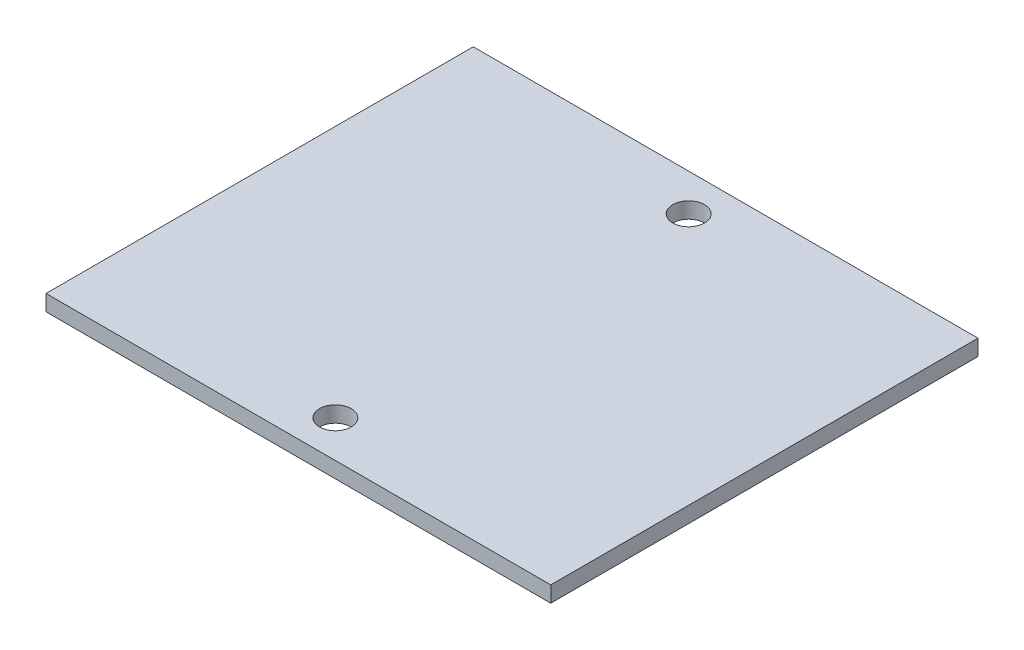
ISO-10303-21;
HEADER;
FILE_DESCRIPTION(('STEP AP214'),'2;1');
FILE_NAME('part.step','',(''),(''),'','','');
FILE_SCHEMA(('AUTOMOTIVE_DESIGN { 1 0 10303 214 1 1 1 1 }'));
ENDSEC;
DATA;
#1=APPLICATION_CONTEXT('core data for automotive mechanical design processes');
#2=APPLICATION_PROTOCOL_DEFINITION('international standard','automotive_design',2000,#1);
#3=PRODUCT_CONTEXT('',#1,'mechanical');
#4=PRODUCT('Part','Part','',(#3));
#5=PRODUCT_RELATED_PRODUCT_CATEGORY('part','',(#4));
#6=PRODUCT_DEFINITION_FORMATION('','',#4);
#7=PRODUCT_DEFINITION_CONTEXT('part definition',#1,'design');
#8=PRODUCT_DEFINITION('design','',#6,#7);
#9=PRODUCT_DEFINITION_SHAPE('','',#8);
#10=(LENGTH_UNIT() NAMED_UNIT(*) SI_UNIT(.MILLI.,.METRE.));
#11=(NAMED_UNIT(*) PLANE_ANGLE_UNIT() SI_UNIT($,.RADIAN.));
#12=(NAMED_UNIT(*) SI_UNIT($,.STERADIAN.) SOLID_ANGLE_UNIT());
#13=UNCERTAINTY_MEASURE_WITH_UNIT(LENGTH_MEASURE(1.E-05),#10,'distance_accuracy_value','');
#14=(GEOMETRIC_REPRESENTATION_CONTEXT(3) GLOBAL_UNCERTAINTY_ASSIGNED_CONTEXT((#13)) GLOBAL_UNIT_ASSIGNED_CONTEXT((#10,
#11,#12)) REPRESENTATION_CONTEXT('',''));
#15=CARTESIAN_POINT('',(0.,0.,0.));
#16=DIRECTION('',(0.,0.,1.));
#17=DIRECTION('',(1.,0.,0.));
#18=AXIS2_PLACEMENT_3D('',#15,#16,#17);
#19=CARTESIAN_POINT('',(0.,1.6002,0.));
#20=DIRECTION('',(0.,-1.,0.));
#21=DIRECTION('',(0.,0.,-1.));
#22=AXIS2_PLACEMENT_3D('',#19,#20,#21);
#23=PLANE('',#22);
#24=DIRECTION('',(0.,0.,1.));
#25=VECTOR('',#24,1.);
#26=CARTESIAN_POINT('',(0.,1.6002,0.));
#27=LINE('',#26,#25);
#28=CARTESIAN_POINT('',(0.,1.6002,-43.));
#29=VERTEX_POINT('',#28);
#30=CARTESIAN_POINT('',(0.,1.6002,0.));
#31=VERTEX_POINT('',#30);
#32=EDGE_CURVE('E89',#29,#31,#27,.T.);
#33=ORIENTED_EDGE('',*,*,#32,.T.);
#34=DIRECTION('',(1.,0.,0.));
#35=VECTOR('',#34,1.);
#36=CARTESIAN_POINT('',(0.,1.6002,0.));
#37=LINE('',#36,#35);
#38=CARTESIAN_POINT('',(50.8,1.6002,0.));
#39=VERTEX_POINT('',#38);
#40=EDGE_CURVE('E84',#31,#39,#37,.T.);
#41=ORIENTED_EDGE('',*,*,#40,.T.);
#42=DIRECTION('',(0.,0.,-1.));
#43=VECTOR('',#42,1.);
#44=CARTESIAN_POINT('',(50.8,1.6002,0.));
#45=LINE('',#44,#43);
#46=CARTESIAN_POINT('',(50.8,1.6002,-43.));
#47=VERTEX_POINT('',#46);
#48=EDGE_CURVE('E87',#39,#47,#45,.T.);
#49=ORIENTED_EDGE('',*,*,#48,.T.);
#50=DIRECTION('',(-1.,0.,0.));
#51=VECTOR('',#50,1.);
#52=CARTESIAN_POINT('',(0.,1.6002,-43.));
#53=LINE('',#52,#51);
#54=EDGE_CURVE('E54',#47,#29,#53,.T.);
#55=ORIENTED_EDGE('',*,*,#54,.T.);
#56=EDGE_LOOP('',(#33,#41,#49,#55));
#57=FACE_BOUND('',#56,.T.);
#58=CARTESIAN_POINT('',(25.4,1.6002,-3.72));
#59=DIRECTION('',(0.,1.,0.));
#60=DIRECTION('',(0.,0.,1.));
#61=AXIS2_PLACEMENT_3D('',#58,#59,#60);
#62=CIRCLE('',#61,1.599999975);
#63=CARTESIAN_POINT('',(25.4,1.6002,-2.120000025));
#64=VERTEX_POINT('',#63);
#65=EDGE_CURVE('E104',#64,#64,#62,.T.);
#66=ORIENTED_EDGE('',*,*,#65,.F.);
#67=EDGE_LOOP('',(#66));
#68=FACE_BOUND('',#67,.T.);
#69=CARTESIAN_POINT('',(25.4,1.6002,-39.28));
#70=DIRECTION('',(0.,1.,0.));
#71=DIRECTION('',(0.,0.,1.));
#72=AXIS2_PLACEMENT_3D('',#69,#70,#71);
#73=CIRCLE('',#72,1.599999975);
#74=CARTESIAN_POINT('',(25.4,1.6002,-37.680000025));
#75=VERTEX_POINT('',#74);
#76=EDGE_CURVE('E119',#75,#75,#73,.T.);
#77=ORIENTED_EDGE('',*,*,#76,.F.);
#78=EDGE_LOOP('',(#77));
#79=FACE_BOUND('',#78,.T.);
#80=ADVANCED_FACE('F37',(#57,#68,#79),#23,.F.);
#81=CARTESIAN_POINT('',(0.,0.,0.));
#82=DIRECTION('',(0.,-1.,0.));
#83=DIRECTION('',(0.,0.,-1.));
#84=AXIS2_PLACEMENT_3D('',#81,#82,#83);
#85=PLANE('',#84);
#86=CARTESIAN_POINT('',(25.4,0.,-3.72));
#87=DIRECTION('',(0.,1.,0.));
#88=DIRECTION('',(0.,0.,1.));
#89=AXIS2_PLACEMENT_3D('',#86,#87,#88);
#90=CIRCLE('',#89,1.599999975);
#91=CARTESIAN_POINT('',(25.4,0.,-2.120000025));
#92=VERTEX_POINT('',#91);
#93=EDGE_CURVE('E116',#92,#92,#90,.T.);
#94=ORIENTED_EDGE('',*,*,#93,.T.);
#95=EDGE_LOOP('',(#94));
#96=FACE_BOUND('',#95,.T.);
#97=DIRECTION('',(0.,0.,1.));
#98=VECTOR('',#97,1.);
#99=CARTESIAN_POINT('',(0.,0.,0.));
#100=LINE('',#99,#98);
#101=CARTESIAN_POINT('',(0.,0.,-43.));
#102=VERTEX_POINT('',#101);
#103=CARTESIAN_POINT('',(0.,0.,0.));
#104=VERTEX_POINT('',#103);
#105=EDGE_CURVE('E101',#102,#104,#100,.T.);
#106=ORIENTED_EDGE('',*,*,#105,.F.);
#107=DIRECTION('',(-1.,0.,0.));
#108=VECTOR('',#107,1.);
#109=CARTESIAN_POINT('',(0.,0.,-43.));
#110=LINE('',#109,#108);
#111=CARTESIAN_POINT('',(50.8,0.,-43.));
#112=VERTEX_POINT('',#111);
#113=EDGE_CURVE('E77',#112,#102,#110,.T.);
#114=ORIENTED_EDGE('',*,*,#113,.F.);
#115=DIRECTION('',(0.,0.,-1.));
#116=VECTOR('',#115,1.);
#117=CARTESIAN_POINT('',(50.8,0.,0.));
#118=LINE('',#117,#116);
#119=CARTESIAN_POINT('',(50.8,0.,0.));
#120=VERTEX_POINT('',#119);
#121=EDGE_CURVE('E71',#120,#112,#118,.T.);
#122=ORIENTED_EDGE('',*,*,#121,.F.);
#123=DIRECTION('',(1.,0.,0.));
#124=VECTOR('',#123,1.);
#125=CARTESIAN_POINT('',(0.,0.,0.));
#126=LINE('',#125,#124);
#127=EDGE_CURVE('E93',#104,#120,#126,.T.);
#128=ORIENTED_EDGE('',*,*,#127,.F.);
#129=EDGE_LOOP('',(#106,#114,#122,#128));
#130=FACE_BOUND('',#129,.T.);
#131=CARTESIAN_POINT('',(25.4,0.,-39.28));
#132=DIRECTION('',(0.,1.,0.));
#133=DIRECTION('',(0.,0.,1.));
#134=AXIS2_PLACEMENT_3D('',#131,#132,#133);
#135=CIRCLE('',#134,1.599999975);
#136=CARTESIAN_POINT('',(25.4,0.,-37.680000025));
#137=VERTEX_POINT('',#136);
#138=EDGE_CURVE('E122',#137,#137,#135,.T.);
#139=ORIENTED_EDGE('',*,*,#138,.T.);
#140=EDGE_LOOP('',(#139));
#141=FACE_BOUND('',#140,.T.);
#142=ADVANCED_FACE('F112',(#96,#130,#141),#85,.T.);
#143=CARTESIAN_POINT('',(0.,1.6002,0.));
#144=DIRECTION('',(1.,0.,0.));
#145=DIRECTION('',(0.,0.,-1.));
#146=AXIS2_PLACEMENT_3D('',#143,#144,#145);
#147=PLANE('',#146);
#148=ORIENTED_EDGE('',*,*,#105,.T.);
#149=DIRECTION('',(0.,-1.,0.));
#150=VECTOR('',#149,1.);
#151=CARTESIAN_POINT('',(0.,1.6002,0.));
#152=LINE('',#151,#150);
#153=EDGE_CURVE('E11',#31,#104,#152,.T.);
#154=ORIENTED_EDGE('',*,*,#153,.F.);
#155=ORIENTED_EDGE('',*,*,#32,.F.);
#156=DIRECTION('',(0.,-1.,0.));
#157=VECTOR('',#156,1.);
#158=CARTESIAN_POINT('',(0.,1.6002,-43.));
#159=LINE('',#158,#157);
#160=EDGE_CURVE('E97',#29,#102,#159,.T.);
#161=ORIENTED_EDGE('',*,*,#160,.T.);
#162=EDGE_LOOP('',(#148,#154,#155,#161));
#163=FACE_BOUND('',#162,.T.);
#164=ADVANCED_FACE('F39',(#163),#147,.F.);
#165=CARTESIAN_POINT('',(0.,1.6002,0.));
#166=DIRECTION('',(0.,0.,-1.));
#167=DIRECTION('',(-1.,0.,0.));
#168=AXIS2_PLACEMENT_3D('',#165,#166,#167);
#169=PLANE('',#168);
#170=ORIENTED_EDGE('',*,*,#127,.T.);
#171=DIRECTION('',(0.,-1.,0.));
#172=VECTOR('',#171,1.);
#173=CARTESIAN_POINT('',(50.8,1.6002,0.));
#174=LINE('',#173,#172);
#175=EDGE_CURVE('E46',#39,#120,#174,.T.);
#176=ORIENTED_EDGE('',*,*,#175,.F.);
#177=ORIENTED_EDGE('',*,*,#40,.F.);
#178=ORIENTED_EDGE('',*,*,#153,.T.);
#179=EDGE_LOOP('',(#170,#176,#177,#178));
#180=FACE_BOUND('',#179,.T.);
#181=ADVANCED_FACE('F92',(#180),#169,.F.);
#182=CARTESIAN_POINT('',(50.8,1.6002,0.));
#183=DIRECTION('',(-1.,0.,0.));
#184=DIRECTION('',(0.,0.,1.));
#185=AXIS2_PLACEMENT_3D('',#182,#183,#184);
#186=PLANE('',#185);
#187=ORIENTED_EDGE('',*,*,#121,.T.);
#188=DIRECTION('',(0.,-1.,0.));
#189=VECTOR('',#188,1.);
#190=CARTESIAN_POINT('',(50.8,1.6002,-43.));
#191=LINE('',#190,#189);
#192=EDGE_CURVE('E94',#47,#112,#191,.T.);
#193=ORIENTED_EDGE('',*,*,#192,.F.);
#194=ORIENTED_EDGE('',*,*,#48,.F.);
#195=ORIENTED_EDGE('',*,*,#175,.T.);
#196=EDGE_LOOP('',(#187,#193,#194,#195));
#197=FACE_BOUND('',#196,.T.);
#198=ADVANCED_FACE('F95',(#197),#186,.F.);
#199=CARTESIAN_POINT('',(0.,1.6002,-43.));
#200=DIRECTION('',(0.,0.,1.));
#201=DIRECTION('',(1.,0.,0.));
#202=AXIS2_PLACEMENT_3D('',#199,#200,#201);
#203=PLANE('',#202);
#204=ORIENTED_EDGE('',*,*,#113,.T.);
#205=ORIENTED_EDGE('',*,*,#160,.F.);
#206=ORIENTED_EDGE('',*,*,#54,.F.);
#207=ORIENTED_EDGE('',*,*,#192,.T.);
#208=EDGE_LOOP('',(#204,#205,#206,#207));
#209=FACE_BOUND('',#208,.T.);
#210=ADVANCED_FACE('F109',(#209),#203,.F.);
#211=CARTESIAN_POINT('',(25.4,1.6002,-3.72));
#212=DIRECTION('',(0.,-1.,0.));
#213=DIRECTION('',(0.,0.,-1.));
#214=AXIS2_PLACEMENT_3D('',#211,#212,#213);
#215=CYLINDRICAL_SURFACE('',#214,1.599999975);
#216=ORIENTED_EDGE('',*,*,#65,.T.);
#217=EDGE_LOOP('',(#216));
#218=FACE_BOUND('',#217,.T.);
#219=ORIENTED_EDGE('',*,*,#93,.F.);
#220=EDGE_LOOP('',(#219));
#221=FACE_BOUND('',#220,.T.);
#222=ADVANCED_FACE('F139',(#218,#221),#215,.F.);
#223=CARTESIAN_POINT('',(25.4,1.6002,-39.28));
#224=DIRECTION('',(0.,-1.,0.));
#225=DIRECTION('',(0.,0.,-1.));
#226=AXIS2_PLACEMENT_3D('',#223,#224,#225);
#227=CYLINDRICAL_SURFACE('',#226,1.599999975);
#228=ORIENTED_EDGE('',*,*,#76,.T.);
#229=EDGE_LOOP('',(#228));
#230=FACE_BOUND('',#229,.T.);
#231=ORIENTED_EDGE('',*,*,#138,.F.);
#232=EDGE_LOOP('',(#231));
#233=FACE_BOUND('',#232,.T.);
#234=ADVANCED_FACE('F128',(#230,#233),#227,.F.);
#235=CLOSED_SHELL('',(#80,#142,#164,#181,#198,#210,#222,#234));
#236=MANIFOLD_SOLID_BREP('B2',#235);
#237=ADVANCED_BREP_SHAPE_REPRESENTATION('',(#18,#236),#14);
#238=SHAPE_DEFINITION_REPRESENTATION(#9,#237);
ENDSEC;
END-ISO-10303-21;
